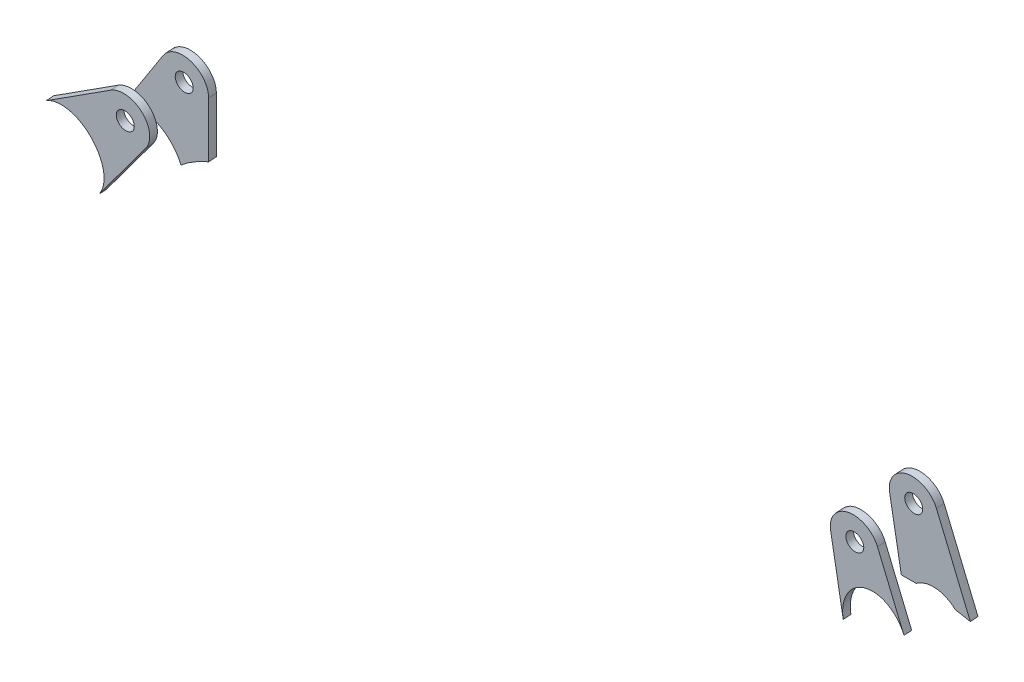
ISO-10303-21;
HEADER;
FILE_DESCRIPTION(('STEP AP214'),'2;1');
FILE_NAME('part.step','',(''),(''),'','','');
FILE_SCHEMA(('AUTOMOTIVE_DESIGN { 1 0 10303 214 1 1 1 1 }'));
ENDSEC;
DATA;
#1=APPLICATION_CONTEXT('core data for automotive mechanical design processes');
#2=APPLICATION_PROTOCOL_DEFINITION('international standard','automotive_design',2000,#1);
#3=PRODUCT_CONTEXT('',#1,'mechanical');
#4=PRODUCT('Part','Part','',(#3));
#5=PRODUCT_RELATED_PRODUCT_CATEGORY('part','',(#4));
#6=PRODUCT_DEFINITION_FORMATION('','',#4);
#7=PRODUCT_DEFINITION_CONTEXT('part definition',#1,'design');
#8=PRODUCT_DEFINITION('design','',#6,#7);
#9=PRODUCT_DEFINITION_SHAPE('','',#8);
#10=(LENGTH_UNIT() NAMED_UNIT(*) SI_UNIT(.MILLI.,.METRE.));
#11=(NAMED_UNIT(*) PLANE_ANGLE_UNIT() SI_UNIT($,.RADIAN.));
#12=(NAMED_UNIT(*) SI_UNIT($,.STERADIAN.) SOLID_ANGLE_UNIT());
#13=UNCERTAINTY_MEASURE_WITH_UNIT(LENGTH_MEASURE(1.E-05),#10,'distance_accuracy_value','');
#14=(GEOMETRIC_REPRESENTATION_CONTEXT(3) GLOBAL_UNCERTAINTY_ASSIGNED_CONTEXT((#13)) GLOBAL_UNIT_ASSIGNED_CONTEXT((#10,
#11,#12)) REPRESENTATION_CONTEXT('',''));
#15=CARTESIAN_POINT('',(0.,0.,0.));
#16=DIRECTION('',(0.,0.,1.));
#17=DIRECTION('',(1.,0.,0.));
#18=AXIS2_PLACEMENT_3D('',#15,#16,#17);
#19=CARTESIAN_POINT('',(1187.27362271244,209.902037191295,105.437735979484));
#20=CARTESIAN_POINT('',(1194.5083932304,186.019488933913,103.927112172512));
#21=CARTESIAN_POINT('',(1245.48987883513,201.401832465751,104.900079298838));
#22=CARTESIAN_POINT('',(1238.25510831716,225.284380723133,106.41070310581));
#23=CARTESIAN_POINT('',(1231.02033779919,249.166928980515,107.921326912782));
#24=CARTESIAN_POINT('',(1180.03885219447,233.784585448677,106.948359786456));
#25=CARTESIAN_POINT('',(1187.27362271244,209.902037191295,105.437735979484));
#26=(BOUNDED_CURVE() B_SPLINE_CURVE(3,(#19,#20,#21,#22,#23,#24,#25),.UNSPECIFIED.,.T.,
.F.) B_SPLINE_CURVE_WITH_KNOTS((4,3,4),(0.,0.5,1.),
.UNSPECIFIED.) CURVE() GEOMETRIC_REPRESENTATION_ITEM() RATIONAL_B_SPLINE_CURVE((1.,
0.333333333333333,0.333333333333333,1.,0.333333333333333,0.333333333333333,1.)) REPRESENTATION_ITEM(''));
#27=DIRECTION('',(-8.3575878583909E-13,-0.0631260510865013,0.998005561945536));
#28=VECTOR('',#27,1.);
#29=SURFACE_OF_LINEAR_EXTRUSION('',#26,#28);
#30=CARTESIAN_POINT('',(1187.27362271243,209.712659038036,108.431752665321));
#31=CARTESIAN_POINT('',(1194.5083932304,185.830110780654,106.921128858349));
#32=CARTESIAN_POINT('',(1245.48987883512,201.212454312491,107.894095984675));
#33=CARTESIAN_POINT('',(1238.25510831716,225.095002569873,109.404719791647));
#34=CARTESIAN_POINT('',(1231.02033779919,248.977550827255,110.915343598619));
#35=CARTESIAN_POINT('',(1180.03885219447,233.595207295418,109.942376472293));
#36=CARTESIAN_POINT('',(1187.27362271243,209.712659038036,108.431752665321));
#37=(BOUNDED_CURVE() B_SPLINE_CURVE(3,(#30,#31,#32,#33,#34,#35,#36),.UNSPECIFIED.,.T.,
.F.) B_SPLINE_CURVE_WITH_KNOTS((4,3,4),(0.,0.5,1.),
.UNSPECIFIED.) CURVE() GEOMETRIC_REPRESENTATION_ITEM() RATIONAL_B_SPLINE_CURVE((1.,
0.333333333333333,0.333333333333333,1.,0.333333333333333,0.333333333333333,1.)) REPRESENTATION_ITEM(''));
#38=CARTESIAN_POINT('',(1203.03694615696,227.107698866066,109.532027267707));
#39=VERTEX_POINT('',#38);
#40=CARTESIAN_POINT('',(1191.83086418841,220.088411076076,109.088041846657));
#41=VERTEX_POINT('',#40);
#42=EDGE_CURVE('E129',#39,#41,#37,.T.);
#43=ORIENTED_EDGE('',*,*,#42,.T.);
#44=DIRECTION('',(-8.3575878583909E-13,-0.0631260510865013,0.998005561945536));
#45=VECTOR('',#44,1.);
#46=CARTESIAN_POINT('',(1191.83086418841,220.277789229335,106.09402516082));
#47=LINE('',#46,#45);
#48=CARTESIAN_POINT('',(1191.83086418841,220.277789229335,106.09402516082));
#49=VERTEX_POINT('',#48);
#50=EDGE_CURVE('E12',#49,#41,#47,.T.);
#51=ORIENTED_EDGE('',*,*,#50,.F.);
#52=CARTESIAN_POINT('',(1203.03694615696,227.297077019326,106.538010581871));
#53=VERTEX_POINT('',#52);
#54=EDGE_CURVE('E117',#53,#49,#26,.T.);
#55=ORIENTED_EDGE('',*,*,#54,.F.);
#56=DIRECTION('',(-8.3575878583909E-13,-0.0631260510865013,0.998005561945536));
#57=VECTOR('',#56,1.);
#58=CARTESIAN_POINT('',(1203.03694615696,227.297077019326,106.538010581871));
#59=LINE('',#58,#57);
#60=EDGE_CURVE('E125',#53,#39,#59,.T.);
#61=ORIENTED_EDGE('',*,*,#60,.T.);
#62=EDGE_LOOP('',(#43,#51,#55,#61));
#63=FACE_BOUND('',#62,.T.);
#64=ADVANCED_FACE('F47',(#63),#29,.F.);
#65=CARTESIAN_POINT('',(1191.83086418841,220.277789229335,106.09402516082));
#66=CARTESIAN_POINT('',(1186.13050383243,238.157629322164,107.224964448286));
#67=CARTESIAN_POINT('',(1169.25353507531,239.801776105636,107.328960355514));
#68=CARTESIAN_POINT('',(1166.16568846541,222.77807922332,106.252174012779));
#69=CARTESIAN_POINT('',(1163.07784185551,205.754382341004,105.175387670043));
#70=CARTESIAN_POINT('',(1178.3469013087,195.245624045875,104.510685549859));
#71=CARTESIAN_POINT('',(1189.38568132259,206.797180511207,105.241346952333));
#72=(BOUNDED_CURVE() B_SPLINE_CURVE(3,(#65,#66,#67,#68,#69,#70,#71),.UNSPECIFIED.,.F.,
.F.) B_SPLINE_CURVE_WITH_KNOTS((4,3,4),(0.,0.5,1.),
.UNSPECIFIED.) CURVE() GEOMETRIC_REPRESENTATION_ITEM() RATIONAL_B_SPLINE_CURVE((1.,
0.506907294636358,0.506907294636358,1.,0.506907294636358,0.506907294636358,1.)) REPRESENTATION_ITEM(''));
#73=DIRECTION('',(-8.3575878583909E-13,-0.0631260510865013,0.998005561945536));
#74=VECTOR('',#73,1.);
#75=SURFACE_OF_LINEAR_EXTRUSION('',#72,#74);
#76=CARTESIAN_POINT('',(1191.83086418841,220.088411076076,109.088041846657));
#77=CARTESIAN_POINT('',(1186.13050383243,237.968251168904,110.218981134123));
#78=CARTESIAN_POINT('',(1169.25353507531,239.612397952377,110.322977041351));
#79=CARTESIAN_POINT('',(1166.16568846541,222.588701070061,109.246190698615));
#80=CARTESIAN_POINT('',(1163.07784185551,205.565004187745,108.16940435588));
#81=CARTESIAN_POINT('',(1178.3469013087,195.056245892616,107.504702235695));
#82=CARTESIAN_POINT('',(1189.38568132258,206.607802357947,108.23536363817));
#83=(BOUNDED_CURVE() B_SPLINE_CURVE(3,(#76,#77,#78,#79,#80,#81,#82),.UNSPECIFIED.,.F.,
.F.) B_SPLINE_CURVE_WITH_KNOTS((4,3,4),(0.,0.5,1.),
.UNSPECIFIED.) CURVE() GEOMETRIC_REPRESENTATION_ITEM() RATIONAL_B_SPLINE_CURVE((1.,
0.506907294636358,0.506907294636358,1.,0.506907294636358,0.506907294636358,1.)) REPRESENTATION_ITEM(''));
#84=CARTESIAN_POINT('',(1167.97984534794,227.173436112143,109.536185293357));
#85=VERTEX_POINT('',#84);
#86=EDGE_CURVE('E134',#41,#85,#83,.T.);
#87=ORIENTED_EDGE('',*,*,#86,.T.);
#88=DIRECTION('',(-8.3575878583909E-13,-0.0631260510865013,0.998005561945536));
#89=VECTOR('',#88,1.);
#90=CARTESIAN_POINT('',(1167.97984534795,227.362814265402,106.54216860752));
#91=LINE('',#90,#89);
#92=CARTESIAN_POINT('',(1167.97984534795,227.362814265402,106.54216860752));
#93=VERTEX_POINT('',#92);
#94=EDGE_CURVE('E56',#93,#85,#91,.T.);
#95=ORIENTED_EDGE('',*,*,#94,.F.);
#96=EDGE_CURVE('E97',#49,#93,#72,.T.);
#97=ORIENTED_EDGE('',*,*,#96,.F.);
#98=ORIENTED_EDGE('',*,*,#50,.T.);
#99=EDGE_LOOP('',(#87,#95,#97,#98));
#100=FACE_BOUND('',#99,.T.);
#101=ADVANCED_FACE('F150',(#100),#75,.F.);
#102=CARTESIAN_POINT('',(702.660949145776,-471.67377247901,62.3265640366125));
#103=DIRECTION('',(-0.83294757607652,0.552248283178659,0.0349309208935801));
#104=DIRECTION('',(-0.552585509997862,-0.833456210091689,0.));
#105=AXIS2_PLACEMENT_3D('',#102,#103,#104);
#106=PLANE('',#105);
#107=DIRECTION('',(-0.553351909284001,-0.83128631373339,-0.0525806912402454));
#108=VECTOR('',#107,1.);
#109=CARTESIAN_POINT('',(702.660949145773,-471.863150632269,65.3205807224491));
#110=LINE('',#109,#108);
#111=CARTESIAN_POINT('',(1187.08699802723,255.877619201086,111.351788128828));
#112=VERTEX_POINT('',#111);
#113=EDGE_CURVE('E109',#112,#85,#110,.T.);
#114=ORIENTED_EDGE('',*,*,#113,.F.);
#115=DIRECTION('',(-8.3575878583909E-13,-0.0631260510865013,0.998005561945536));
#116=VECTOR('',#115,1.);
#117=CARTESIAN_POINT('',(1187.08699802723,256.066997354345,108.357771442992));
#118=LINE('',#117,#116);
#119=CARTESIAN_POINT('',(1187.08699802723,256.066997354345,108.357771442992));
#120=VERTEX_POINT('',#119);
#121=EDGE_CURVE('E103',#120,#112,#118,.T.);
#122=ORIENTED_EDGE('',*,*,#121,.F.);
#123=DIRECTION('',(-0.553351909284001,-0.83128631373339,-0.0525806912402454));
#124=VECTOR('',#123,1.);
#125=CARTESIAN_POINT('',(702.660949145776,-471.67377247901,62.3265640366125));
#126=LINE('',#125,#124);
#127=EDGE_CURVE('E107',#120,#93,#126,.T.);
#128=ORIENTED_EDGE('',*,*,#127,.T.);
#129=ORIENTED_EDGE('',*,*,#94,.T.);
#130=EDGE_LOOP('',(#114,#122,#128,#129));
#131=FACE_BOUND('',#130,.T.);
#132=ADVANCED_FACE('F105',(#131),#106,.T.);
#133=CARTESIAN_POINT('',(1194.99999999992,250.820638664096,108.025927694499));
#134=DIRECTION('',(-8.3575878583909E-13,-0.0631260510865013,0.998005561945536));
#135=DIRECTION('',(0.,-0.998005561945536,-0.0631260510865013));
#136=AXIS2_PLACEMENT_3D('',#133,#134,#135);
#137=CYLINDRICAL_SURFACE('',#136,9.50000000000025);
#138=CARTESIAN_POINT('',(1194.99999999992,250.631260510836,111.019944380336));
#139=DIRECTION('',(8.35768954043914E-13,0.0631260510865013,-0.998005561945536));
#140=DIRECTION('',(0.,0.998005561945536,0.0631260510865013));
#141=AXIS2_PLACEMENT_3D('',#138,#139,#140);
#142=CIRCLE('',#141,9.50000000000025);
#143=CARTESIAN_POINT('',(1204.48128229763,250.03639059854,110.982317547483));
#144=VERTEX_POINT('',#143);
#145=EDGE_CURVE('E83',#112,#144,#142,.T.);
#146=ORIENTED_EDGE('',*,*,#145,.T.);
#147=DIRECTION('',(-8.3575878583909E-13,-0.0631260510865013,0.998005561945536));
#148=VECTOR('',#147,1.);
#149=CARTESIAN_POINT('',(1204.48128229764,250.2257687518,107.988300861647));
#150=LINE('',#149,#148);
#151=CARTESIAN_POINT('',(1204.48128229764,250.2257687518,107.988300861647));
#152=VERTEX_POINT('',#151);
#153=EDGE_CURVE('E110',#152,#144,#150,.T.);
#154=ORIENTED_EDGE('',*,*,#153,.F.);
#155=CARTESIAN_POINT('',(1194.99999999992,250.820638664096,108.025927694499));
#156=DIRECTION('',(8.35768954043914E-13,0.0631260510865013,-0.998005561945536));
#157=DIRECTION('',(0.,0.998005561945536,0.0631260510865013));
#158=AXIS2_PLACEMENT_3D('',#155,#156,#157);
#159=CIRCLE('',#158,9.50000000000025);
#160=EDGE_CURVE('E112',#120,#152,#159,.T.);
#161=ORIENTED_EDGE('',*,*,#160,.F.);
#162=ORIENTED_EDGE('',*,*,#121,.T.);
#163=EDGE_LOOP('',(#146,#154,#161,#162));
#164=FACE_BOUND('',#163,.T.);
#165=ADVANCED_FACE('F113',(#164),#137,.T.);
#166=CARTESIAN_POINT('',(1194.99999999992,250.820638664096,108.025927694499));
#167=DIRECTION('',(-8.3575878583909E-13,-0.0631260510865013,0.998005561945536));
#168=DIRECTION('',(0.,-0.998005561945536,-0.0631260510865013));
#169=AXIS2_PLACEMENT_3D('',#166,#167,#168);
#170=CYLINDRICAL_SURFACE('',#169,3.49999999999995);
#171=CARTESIAN_POINT('',(1194.99999999992,250.820638664096,108.025927694499));
#172=DIRECTION('',(8.35768954043914E-13,0.0631260510865013,-0.998005561945536));
#173=DIRECTION('',(0.,0.998005561945536,0.0631260510865013));
#174=AXIS2_PLACEMENT_3D('',#171,#172,#173);
#175=CIRCLE('',#174,3.49999999999995);
#176=CARTESIAN_POINT('',(1194.99999999992,254.313658130905,108.246868873302));
#177=VERTEX_POINT('',#176);
#178=EDGE_CURVE('E148',#177,#177,#175,.T.);
#179=ORIENTED_EDGE('',*,*,#178,.T.);
#180=EDGE_LOOP('',(#179));
#181=FACE_BOUND('',#180,.T.);
#182=CARTESIAN_POINT('',(1194.99999999992,250.631260510836,111.019944380336));
#183=DIRECTION('',(8.35768954043914E-13,0.0631260510865013,-0.998005561945536));
#184=DIRECTION('',(0.,0.998005561945536,0.0631260510865013));
#185=AXIS2_PLACEMENT_3D('',#182,#183,#184);
#186=CIRCLE('',#185,3.49999999999995);
#187=CARTESIAN_POINT('',(1194.99999999992,254.124279977646,111.240885559139));
#188=VERTEX_POINT('',#187);
#189=EDGE_CURVE('E126',#188,#188,#186,.T.);
#190=ORIENTED_EDGE('',*,*,#189,.F.);
#191=EDGE_LOOP('',(#190));
#192=FACE_BOUND('',#191,.T.);
#193=ADVANCED_FACE('F49',(#181,#192),#170,.F.);
#194=CARTESIAN_POINT('',(1183.67501105942,-80.0717055605428,87.0962577386059));
#195=DIRECTION('',(-0.998029715544938,0.0626178855623673,0.00396071925130242));
#196=DIRECTION('',(-0.0626183767208298,-0.998037543831317,0.));
#197=AXIS2_PLACEMENT_3D('',#194,#195,#196);
#198=PLANE('',#197);
#199=DIRECTION('',(-0.0627430226343086,-0.996039207100766,-0.0630016748093885));
#200=VECTOR('',#199,1.);
#201=CARTESIAN_POINT('',(1183.67501105942,-80.2610837138023,90.0902744244425));
#202=LINE('',#201,#200);
#203=EDGE_CURVE('E89',#144,#39,#202,.T.);
#204=ORIENTED_EDGE('',*,*,#203,.T.);
#205=ORIENTED_EDGE('',*,*,#60,.F.);
#206=DIRECTION('',(-0.0627430226343086,-0.996039207100766,-0.0630016748093885));
#207=VECTOR('',#206,1.);
#208=CARTESIAN_POINT('',(1183.67501105942,-80.0717055605428,87.0962577386059));
#209=LINE('',#208,#207);
#210=EDGE_CURVE('E64',#152,#53,#209,.T.);
#211=ORIENTED_EDGE('',*,*,#210,.F.);
#212=ORIENTED_EDGE('',*,*,#153,.T.);
#213=EDGE_LOOP('',(#204,#205,#211,#212));
#214=FACE_BOUND('',#213,.T.);
#215=ADVANCED_FACE('F157',(#214),#198,.F.);
#216=CARTESIAN_POINT('',(-7.68716854997691E-11,-5.80615491500186,91.7937174740899));
#217=DIRECTION('',(8.35768954043914E-13,0.0631260510865013,-0.998005561945536));
#218=DIRECTION('',(0.,0.998005561945536,0.0631260510865013));
#219=AXIS2_PLACEMENT_3D('',#216,#217,#218);
#220=PLANE('',#219);
#221=ORIENTED_EDGE('',*,*,#178,.F.);
#222=EDGE_LOOP('',(#221));
#223=FACE_BOUND('',#222,.T.);
#224=ORIENTED_EDGE('',*,*,#54,.T.);
#225=ORIENTED_EDGE('',*,*,#96,.T.);
#226=ORIENTED_EDGE('',*,*,#127,.F.);
#227=ORIENTED_EDGE('',*,*,#160,.T.);
#228=ORIENTED_EDGE('',*,*,#210,.T.);
#229=EDGE_LOOP('',(#224,#225,#226,#227,#228));
#230=FACE_BOUND('',#229,.T.);
#231=ADVANCED_FACE('F115',(#223,#230),#220,.T.);
#232=CARTESIAN_POINT('',(-7.93789618572864E-11,-5.99553306826137,94.7877341599265));
#233=DIRECTION('',(8.35768954043914E-13,0.0631260510865013,-0.998005561945536));
#234=DIRECTION('',(0.,0.998005561945536,0.0631260510865013));
#235=AXIS2_PLACEMENT_3D('',#232,#233,#234);
#236=PLANE('',#235);
#237=ORIENTED_EDGE('',*,*,#189,.T.);
#238=EDGE_LOOP('',(#237));
#239=FACE_BOUND('',#238,.T.);
#240=ORIENTED_EDGE('',*,*,#42,.F.);
#241=ORIENTED_EDGE('',*,*,#203,.F.);
#242=ORIENTED_EDGE('',*,*,#145,.F.);
#243=ORIENTED_EDGE('',*,*,#113,.T.);
#244=ORIENTED_EDGE('',*,*,#86,.F.);
#245=EDGE_LOOP('',(#240,#241,#242,#243,#244));
#246=FACE_BOUND('',#245,.T.);
#247=ADVANCED_FACE('F154',(#239,#246),#236,.F.);
#248=CLOSED_SHELL('',(#64,#101,#132,#165,#193,#215,#231,#247));
#249=MANIFOLD_SOLID_BREP('B2',#248);
#250=CARTESIAN_POINT('',(1499.08196942417,220.084161998798,106.081777812052));
#251=CARTESIAN_POINT('',(1496.21099658965,220.657520619572,106.118044008317));
#252=CARTESIAN_POINT('',(1493.33840835791,221.22603817707,106.154003996662));
#253=B_SPLINE_CURVE_WITH_KNOTS('',2,(#250,#251,#252),.UNSPECIFIED.,.F.,.F.,(3,3),(0.,1.),.UNSPECIFIED.);
#254=DIRECTION('',(-8.3575878583909E-13,-0.0631260510865013,0.998005561945536));
#255=VECTOR('',#254,1.);
#256=SURFACE_OF_LINEAR_EXTRUSION('',#253,#255);
#257=CARTESIAN_POINT('',(1499.08196942416,219.894783845539,109.075794497888));
#258=CARTESIAN_POINT('',(1496.21099658965,220.468142466313,109.112060694154));
#259=CARTESIAN_POINT('',(1493.33840835791,221.03666002381,109.148020682499));
#260=B_SPLINE_CURVE_WITH_KNOTS('',2,(#257,#258,#259),.UNSPECIFIED.,.F.,.F.,(3,3),(0.,1.),.UNSPECIFIED.);
#261=CARTESIAN_POINT('',(1499.0819694242,219.894783845435,109.075794497882));
#262=VERTEX_POINT('',#261);
#263=CARTESIAN_POINT('',(1493.33840835791,221.03666002381,109.148020682499));
#264=VERTEX_POINT('',#263);
#265=EDGE_CURVE('E348',#262,#264,#260,.T.);
#266=ORIENTED_EDGE('',*,*,#265,.T.);
#267=CARTESIAN_POINT('',(1493.33840835793,221.226038177067,106.154003996662));
#268=DIRECTION('',(-8.1416355139178E-13,-0.063126051086502,0.998005561945536));
#269=VECTOR('',#268,1.);
#270=LINE('',#267,#269);
#271=CARTESIAN_POINT('',(1493.33840835791,221.22603817707,106.154003996662));
#272=VERTEX_POINT('',#271);
#273=EDGE_CURVE('E45',#272,#264,#270,.T.);
#274=ORIENTED_EDGE('',*,*,#273,.F.);
#275=CARTESIAN_POINT('',(1493.33840835791,221.22603817707,106.154003996662));
#276=CARTESIAN_POINT('',(1496.21099658965,220.657520619572,106.118044008317));
#277=CARTESIAN_POINT('',(1499.08196942417,220.084161998798,106.081777812052));
#278=B_SPLINE_CURVE_WITH_KNOTS('',2,(#275,#276,#277),.UNSPECIFIED.,.F.,.F.,(3,3),(0.,1.),.UNSPECIFIED.);
#279=CARTESIAN_POINT('',(1499.0819694242,220.084161998694,106.081777812045));
#280=VERTEX_POINT('',#279);
#281=EDGE_CURVE('E501',#280,#272,#278,.F.);
#282=ORIENTED_EDGE('',*,*,#281,.F.);
#283=CARTESIAN_POINT('',(1499.08196942417,220.084161998798,106.081777812052));
#284=DIRECTION('',(-8.14163551391784E-13,-0.0631260510865023,0.998005561945536));
#285=VECTOR('',#284,1.);
#286=LINE('',#283,#285);
#287=EDGE_CURVE('E341',#280,#262,#286,.T.);
#288=ORIENTED_EDGE('',*,*,#287,.T.);
#289=EDGE_LOOP('',(#266,#274,#282,#288));
#290=FACE_BOUND('',#289,.T.);
#291=ADVANCED_FACE('F249',(#290),#256,.F.);
#292=CARTESIAN_POINT('',(1493.33840835793,221.226038177067,106.154003996662));
#293=CARTESIAN_POINT('',(1488.96893009491,225.763394960686,106.441001812144));
#294=CARTESIAN_POINT('',(1483.12142418807,226.290290564838,106.474329120215));
#295=CARTESIAN_POINT('',(1478.20006201535,222.590094625938,106.240283572996));
#296=(BOUNDED_CURVE() B_SPLINE_CURVE(3,(#292,#293,#294,#295),.UNSPECIFIED.,.F.,
.F.) B_SPLINE_CURVE_WITH_KNOTS((4,4),(0.,1.),
.UNSPECIFIED.) CURVE() GEOMETRIC_REPRESENTATION_ITEM() RATIONAL_B_SPLINE_CURVE((1.,
0.862951748646617,0.862951748646617,1.)) REPRESENTATION_ITEM(''));
#297=DIRECTION('',(-8.3575878583909E-13,-0.0631260510865013,0.998005561945536));
#298=VECTOR('',#297,1.);
#299=SURFACE_OF_LINEAR_EXTRUSION('',#296,#298);
#300=CARTESIAN_POINT('',(1493.33840835793,221.036660023808,109.148020682499));
#301=CARTESIAN_POINT('',(1488.96893009491,225.574016807427,109.43501849798));
#302=CARTESIAN_POINT('',(1483.12142418807,226.100912411578,109.468345806052));
#303=CARTESIAN_POINT('',(1478.20006201534,222.400716472678,109.234300258833));
#304=(BOUNDED_CURVE() B_SPLINE_CURVE(3,(#300,#301,#302,#303),.UNSPECIFIED.,.F.,
.F.) B_SPLINE_CURVE_WITH_KNOTS((4,4),(0.,1.),
.UNSPECIFIED.) CURVE() GEOMETRIC_REPRESENTATION_ITEM() RATIONAL_B_SPLINE_CURVE((1.,
0.862951748646617,0.862951748646617,1.)) REPRESENTATION_ITEM(''));
#305=CARTESIAN_POINT('',(1478.20006201541,222.40071647268,109.234300258833));
#306=VERTEX_POINT('',#305);
#307=EDGE_CURVE('E382',#264,#306,#304,.T.);
#308=ORIENTED_EDGE('',*,*,#307,.T.);
#309=CARTESIAN_POINT('',(1478.20006201541,222.590094625939,106.240283572996));
#310=DIRECTION('',(-8.1416355139178E-13,-0.063126051086502,0.998005561945536));
#311=VECTOR('',#310,1.);
#312=LINE('',#309,#311);
#313=CARTESIAN_POINT('',(1478.20006201541,222.590094625939,106.240283572996));
#314=VERTEX_POINT('',#313);
#315=EDGE_CURVE('E260',#314,#306,#312,.T.);
#316=ORIENTED_EDGE('',*,*,#315,.F.);
#317=EDGE_CURVE('E304',#272,#314,#296,.T.);
#318=ORIENTED_EDGE('',*,*,#317,.F.);
#319=ORIENTED_EDGE('',*,*,#273,.T.);
#320=EDGE_LOOP('',(#308,#316,#318,#319));
#321=FACE_BOUND('',#320,.T.);
#322=ADVANCED_FACE('F417',(#321),#299,.F.);
#323=CARTESIAN_POINT('',(1478.20006201541,222.590094625939,106.240283572996));
#324=CARTESIAN_POINT('',(1475.2865055703,222.571793232289,106.239125969515));
#325=CARTESIAN_POINT('',(1472.3780187023,222.55013712231,106.237756172833));
#326=B_SPLINE_CURVE_WITH_KNOTS('',2,(#323,#324,#325),.UNSPECIFIED.,.F.,.F.,(3,3),(0.,1.),.UNSPECIFIED.);
#327=DIRECTION('',(-8.3575878583909E-13,-0.0631260510865013,0.998005561945536));
#328=VECTOR('',#327,1.);
#329=SURFACE_OF_LINEAR_EXTRUSION('',#326,#328);
#330=CARTESIAN_POINT('',(1478.20006201541,222.40071647268,109.234300258833));
#331=CARTESIAN_POINT('',(1475.2865055703,222.382415079029,109.233142655351));
#332=CARTESIAN_POINT('',(1472.3780187023,222.36075896905,109.231772858669));
#333=B_SPLINE_CURVE_WITH_KNOTS('',2,(#330,#331,#332),.UNSPECIFIED.,.F.,.F.,(3,3),(0.,1.),.UNSPECIFIED.);
#334=CARTESIAN_POINT('',(1472.37801870234,222.360758968719,109.231772858648));
#335=VERTEX_POINT('',#334);
#336=EDGE_CURVE('E384',#306,#335,#333,.T.);
#337=ORIENTED_EDGE('',*,*,#336,.T.);
#338=CARTESIAN_POINT('',(1472.3780187023,222.36075896905,109.231772858669));
#339=DIRECTION('',(8.1416355139178E-13,0.063126051086502,-0.998005561945536));
#340=VECTOR('',#339,1.);
#341=LINE('',#338,#340);
#342=CARTESIAN_POINT('',(1472.37801870234,222.550137121978,106.237756172812));
#343=VERTEX_POINT('',#342);
#344=EDGE_CURVE('E320',#343,#335,#341,.F.);
#345=ORIENTED_EDGE('',*,*,#344,.F.);
#346=CARTESIAN_POINT('',(1472.3780187023,222.55013712231,106.237756172833));
#347=CARTESIAN_POINT('',(1475.2865055703,222.571793232289,106.239125969515));
#348=CARTESIAN_POINT('',(1478.20006201541,222.590094625939,106.240283572996));
#349=B_SPLINE_CURVE_WITH_KNOTS('',2,(#346,#347,#348),.UNSPECIFIED.,.F.,.F.,(3,3),(0.,1.),.UNSPECIFIED.);
#350=EDGE_CURVE('E328',#314,#343,#349,.F.);
#351=ORIENTED_EDGE('',*,*,#350,.F.);
#352=ORIENTED_EDGE('',*,*,#315,.T.);
#353=EDGE_LOOP('',(#337,#345,#351,#352));
#354=FACE_BOUND('',#353,.T.);
#355=ADVANCED_FACE('F412',(#354),#329,.F.);
#356=CARTESIAN_POINT('',(1480.21243523966,146.924027649801,101.45423809231));
#357=DIRECTION('',(-0.994697983824757,-0.102634190234857,-0.00649183870697924));
#358=DIRECTION('',(0.102636353009325,-0.994718944748186,0.));
#359=AXIS2_PLACEMENT_3D('',#356,#357,#358);
#360=PLANE('',#359);
#361=DIRECTION('',(0.102839296842025,-0.992714120313124,-0.0627913557424757));
#362=VECTOR('',#361,1.);
#363=CARTESIAN_POINT('',(1480.21243523966,146.734649496541,104.448254778147));
#364=LINE('',#363,#362);
#365=CARTESIAN_POINT('',(1469.55036915351,249.65623570392,110.958271912878));
#366=VERTEX_POINT('',#365);
#367=EDGE_CURVE('E319',#366,#335,#364,.T.);
#368=ORIENTED_EDGE('',*,*,#367,.F.);
#369=DIRECTION('',(-8.3575878583909E-13,-0.0631260510865013,0.998005561945536));
#370=VECTOR('',#369,1.);
#371=CARTESIAN_POINT('',(1469.55036915351,249.84561385718,107.964255227041));
#372=LINE('',#371,#370);
#373=CARTESIAN_POINT('',(1469.55036915351,249.84561385718,107.964255227041));
#374=VERTEX_POINT('',#373);
#375=EDGE_CURVE('E313',#374,#366,#372,.T.);
#376=ORIENTED_EDGE('',*,*,#375,.F.);
#377=DIRECTION('',(0.102839296842025,-0.992714120313124,-0.0627913557424757));
#378=VECTOR('',#377,1.);
#379=CARTESIAN_POINT('',(1480.21243523966,146.924027649801,101.45423809231));
#380=LINE('',#379,#378);
#381=EDGE_CURVE('E317',#374,#343,#380,.T.);
#382=ORIENTED_EDGE('',*,*,#381,.T.);
#383=ORIENTED_EDGE('',*,*,#344,.T.);
#384=EDGE_LOOP('',(#368,#376,#382,#383));
#385=FACE_BOUND('',#384,.T.);
#386=ADVANCED_FACE('F315',(#385),#360,.T.);
#387=CARTESIAN_POINT('',(1478.99999999992,250.820638664133,108.02592769474));
#388=DIRECTION('',(-8.3575878583909E-13,-0.0631260510865013,0.998005561945536));
#389=DIRECTION('',(0.,-0.998005561945536,-0.0631260510865013));
#390=AXIS2_PLACEMENT_3D('',#387,#388,#389);
#391=CYLINDRICAL_SURFACE('',#390,9.49999999996091);
#392=CARTESIAN_POINT('',(1478.99999999992,250.631260510873,111.019944380576));
#393=DIRECTION('',(8.35768954043914E-13,0.0631260510865013,-0.998005561945536));
#394=DIRECTION('',(0.,0.998005561945536,0.0631260510865013));
#395=AXIS2_PLACEMENT_3D('',#392,#393,#394);
#396=CIRCLE('',#395,9.49999999996091);
#397=CARTESIAN_POINT('',(1488.02823215257,253.581886224663,111.206577959241));
#398=VERTEX_POINT('',#397);
#399=EDGE_CURVE('E290',#366,#398,#396,.T.);
#400=ORIENTED_EDGE('',*,*,#399,.T.);
#401=DIRECTION('',(-8.3575878583909E-13,-0.0631260510865013,0.998005561945536));
#402=VECTOR('',#401,1.);
#403=CARTESIAN_POINT('',(1488.02823215257,253.771264377922,108.212561273405));
#404=LINE('',#403,#402);
#405=CARTESIAN_POINT('',(1488.02823215257,253.771264377922,108.212561273405));
#406=VERTEX_POINT('',#405);
#407=EDGE_CURVE('E321',#406,#398,#404,.T.);
#408=ORIENTED_EDGE('',*,*,#407,.F.);
#409=CARTESIAN_POINT('',(1478.99999999992,250.820638664133,108.02592769474));
#410=DIRECTION('',(8.35768954043914E-13,0.0631260510865013,-0.998005561945536));
#411=DIRECTION('',(0.,0.998005561945536,0.0631260510865013));
#412=AXIS2_PLACEMENT_3D('',#409,#410,#411);
#413=CIRCLE('',#412,9.49999999996091);
#414=EDGE_CURVE('E323',#374,#406,#413,.T.);
#415=ORIENTED_EDGE('',*,*,#414,.F.);
#416=ORIENTED_EDGE('',*,*,#375,.T.);
#417=EDGE_LOOP('',(#400,#408,#415,#416));
#418=FACE_BOUND('',#417,.T.);
#419=ADVANCED_FACE('F324',(#418),#391,.T.);
#420=CARTESIAN_POINT('',(1478.99999999992,250.820638664133,108.02592769474));
#421=DIRECTION('',(-8.3575878583909E-13,-0.0631260510865013,0.998005561945536));
#422=DIRECTION('',(0.,-0.998005561945536,-0.0631260510865013));
#423=AXIS2_PLACEMENT_3D('',#420,#421,#422);
#424=CYLINDRICAL_SURFACE('',#423,3.49999999999974);
#425=CARTESIAN_POINT('',(1478.99999999992,250.820638664133,108.02592769474));
#426=DIRECTION('',(8.35768954043914E-13,0.0631260510865013,-0.998005561945536));
#427=DIRECTION('',(0.,0.998005561945536,0.0631260510865013));
#428=AXIS2_PLACEMENT_3D('',#425,#426,#427);
#429=CIRCLE('',#428,3.49999999999974);
#430=CARTESIAN_POINT('',(1478.99999999992,254.313658130942,108.246868873542));
#431=VERTEX_POINT('',#430);
#432=EDGE_CURVE('E397',#431,#431,#429,.T.);
#433=ORIENTED_EDGE('',*,*,#432,.T.);
#434=EDGE_LOOP('',(#433));
#435=FACE_BOUND('',#434,.T.);
#436=CARTESIAN_POINT('',(1478.99999999992,250.631260510873,111.019944380576));
#437=DIRECTION('',(8.35768954043914E-13,0.0631260510865013,-0.998005561945536));
#438=DIRECTION('',(0.,0.998005561945536,0.0631260510865013));
#439=AXIS2_PLACEMENT_3D('',#436,#437,#438);
#440=CIRCLE('',#439,3.49999999999974);
#441=CARTESIAN_POINT('',(1478.99999999992,254.124279977682,111.240885559379));
#442=VERTEX_POINT('',#441);
#443=EDGE_CURVE('E374',#442,#442,#440,.T.);
#444=ORIENTED_EDGE('',*,*,#443,.F.);
#445=EDGE_LOOP('',(#444));
#446=FACE_BOUND('',#445,.T.);
#447=ADVANCED_FACE('F251',(#435,#446),#424,.F.);
#448=CARTESIAN_POINT('',(1420.83310998599,458.5534936082,121.165488548421));
#449=DIRECTION('',(-0.950340226609853,-0.310592180393613,-0.0196456398591287));
#450=DIRECTION('',(0.310652134455682,-0.950523672171361,0.));
#451=AXIS2_PLACEMENT_3D('',#448,#449,#450);
#452=PLANE('',#451);
#453=DIRECTION('',(0.311212875194992,-0.948444831897231,-0.0599912256942712));
#454=VECTOR('',#453,1.);
#455=CARTESIAN_POINT('',(1420.83310998599,458.364115454941,124.159505234257));
#456=LINE('',#455,#454);
#457=EDGE_CURVE('E296',#398,#262,#456,.T.);
#458=ORIENTED_EDGE('',*,*,#457,.T.);
#459=ORIENTED_EDGE('',*,*,#287,.F.);
#460=DIRECTION('',(0.311212875194992,-0.948444831897231,-0.0599912256942712));
#461=VECTOR('',#460,1.);
#462=CARTESIAN_POINT('',(1420.83310998599,458.5534936082,121.165488548421));
#463=LINE('',#462,#461);
#464=EDGE_CURVE('E268',#406,#280,#463,.T.);
#465=ORIENTED_EDGE('',*,*,#464,.F.);
#466=ORIENTED_EDGE('',*,*,#407,.T.);
#467=EDGE_LOOP('',(#458,#459,#465,#466));
#468=FACE_BOUND('',#467,.T.);
#469=ADVANCED_FACE('F367',(#468),#452,.F.);
#470=CARTESIAN_POINT('',(-7.68716854997691E-11,-5.80615491500186,91.7937174740899));
#471=DIRECTION('',(8.35768954043914E-13,0.0631260510865013,-0.998005561945536));
#472=DIRECTION('',(0.,0.998005561945536,0.0631260510865013));
#473=AXIS2_PLACEMENT_3D('',#470,#471,#472);
#474=PLANE('',#473);
#475=ORIENTED_EDGE('',*,*,#432,.F.);
#476=EDGE_LOOP('',(#475));
#477=FACE_BOUND('',#476,.T.);
#478=ORIENTED_EDGE('',*,*,#281,.T.);
#479=ORIENTED_EDGE('',*,*,#317,.T.);
#480=ORIENTED_EDGE('',*,*,#350,.T.);
#481=ORIENTED_EDGE('',*,*,#381,.F.);
#482=ORIENTED_EDGE('',*,*,#414,.T.);
#483=ORIENTED_EDGE('',*,*,#464,.T.);
#484=EDGE_LOOP('',(#478,#479,#480,#481,#482,#483));
#485=FACE_BOUND('',#484,.T.);
#486=ADVANCED_FACE('F326',(#477,#485),#474,.T.);
#487=CARTESIAN_POINT('',(-7.93789618572864E-11,-5.99553306826137,94.7877341599265));
#488=DIRECTION('',(8.35768954043914E-13,0.0631260510865013,-0.998005561945536));
#489=DIRECTION('',(0.,0.998005561945536,0.0631260510865013));
#490=AXIS2_PLACEMENT_3D('',#487,#488,#489);
#491=PLANE('',#490);
#492=ORIENTED_EDGE('',*,*,#443,.T.);
#493=EDGE_LOOP('',(#492));
#494=FACE_BOUND('',#493,.T.);
#495=ORIENTED_EDGE('',*,*,#265,.F.);
#496=ORIENTED_EDGE('',*,*,#457,.F.);
#497=ORIENTED_EDGE('',*,*,#399,.F.);
#498=ORIENTED_EDGE('',*,*,#367,.T.);
#499=ORIENTED_EDGE('',*,*,#336,.F.);
#500=ORIENTED_EDGE('',*,*,#307,.F.);
#501=EDGE_LOOP('',(#495,#496,#497,#498,#499,#500));
#502=FACE_BOUND('',#501,.T.);
#503=ADVANCED_FACE('F355',(#494,#502),#491,.F.);
#504=CLOSED_SHELL('',(#291,#322,#355,#386,#419,#447,#469,#486,#503));
#505=MANIFOLD_SOLID_BREP('B6',#504);
#506=CARTESIAN_POINT('',(645.224181576412,-493.486146821277,86.9988423101958));
#507=DIRECTION('',(0.798160373048524,-0.60124349461881,-0.0380299759873861));
#508=DIRECTION('',(0.60167874974324,0.798738181200455,0.));
#509=AXIS2_PLACEMENT_3D('',#506,#507,#508);
#510=PLANE('',#509);
#511=DIRECTION('',(-0.602445033920142,-0.796568491626919,-0.0503847124847846));
#512=VECTOR('',#511,1.);
#513=CARTESIAN_POINT('',(645.224181576414,-493.296768668018,84.0048256243592));
#514=LINE('',#513,#512);
#515=CARTESIAN_POINT('',(1202.5825235439,243.656926290272,130.618770847369));
#516=VERTEX_POINT('',#515);
#517=CARTESIAN_POINT('',(1182.76254687984,217.450437687256,128.961152692273));
#518=VERTEX_POINT('',#517);
#519=EDGE_CURVE('E724',#516,#518,#514,.T.);
#520=ORIENTED_EDGE('',*,*,#519,.F.);
#521=DIRECTION('',(8.3575878583909E-13,0.0631260510865013,-0.998005561945536));
#522=VECTOR('',#521,1.);
#523=CARTESIAN_POINT('',(1202.5825235439,243.467548137012,133.612787533206));
#524=LINE('',#523,#522);
#525=CARTESIAN_POINT('',(1202.5825235439,243.467548137012,133.612787533206));
#526=VERTEX_POINT('',#525);
#527=EDGE_CURVE('E247',#526,#516,#524,.T.);
#528=ORIENTED_EDGE('',*,*,#527,.F.);
#529=DIRECTION('',(-0.602445033920142,-0.796568491626919,-0.0503847124847846));
#530=VECTOR('',#529,1.);
#531=CARTESIAN_POINT('',(645.224181576412,-493.486146821277,86.9988423101958));
#532=LINE('',#531,#530);
#533=CARTESIAN_POINT('',(1182.76254687984,217.261059533997,131.955169378109));
#534=VERTEX_POINT('',#533);
#535=EDGE_CURVE('E702',#526,#534,#532,.T.);
#536=ORIENTED_EDGE('',*,*,#535,.T.);
#537=DIRECTION('',(8.3575878583909E-13,0.0631260510865013,-0.998005561945536));
#538=VECTOR('',#537,1.);
#539=CARTESIAN_POINT('',(1182.76254687984,217.261059533997,131.955169378109));
#540=LINE('',#539,#538);
#541=EDGE_CURVE('E647',#534,#518,#540,.T.);
#542=ORIENTED_EDGE('',*,*,#541,.T.);
#543=EDGE_LOOP('',(#520,#528,#536,#542));
#544=FACE_BOUND('',#543,.T.);
#545=ADVANCED_FACE('F643',(#544),#510,.T.);
#546=CARTESIAN_POINT('',(1194.9999999999,249.179361335847,133.974072305083));
#547=DIRECTION('',(8.3575878583909E-13,0.0631260510865013,-0.998005561945536));
#548=DIRECTION('',(0.,0.998005561945536,0.0631260510865013));
#549=AXIS2_PLACEMENT_3D('',#546,#547,#548);
#550=CYLINDRICAL_SURFACE('',#549,9.50000000000079);
#551=CARTESIAN_POINT('',(1194.9999999999,249.368739489106,130.980055619247));
#552=DIRECTION('',(8.35775892937818E-13,0.0631260510865013,-0.998005561945536));
#553=DIRECTION('',(0.,0.998005561945536,0.0631260510865013));
#554=AXIS2_PLACEMENT_3D('',#551,#552,#553);
#555=CIRCLE('',#554,9.50000000000079);
#556=CARTESIAN_POINT('',(1189.77845263364,257.289247838645,131.481045226684));
#557=VERTEX_POINT('',#556);
#558=EDGE_CURVE('E730',#557,#516,#555,.T.);
#559=ORIENTED_EDGE('',*,*,#558,.F.);
#560=DIRECTION('',(8.3575878583909E-13,0.0631260510865013,-0.998005561945536));
#561=VECTOR('',#560,1.);
#562=CARTESIAN_POINT('',(1189.77845263364,257.099869685385,134.475061912521));
#563=LINE('',#562,#561);
#564=CARTESIAN_POINT('',(1189.77845263364,257.099869685385,134.475061912521));
#565=VERTEX_POINT('',#564);
#566=EDGE_CURVE('E653',#565,#557,#563,.T.);
#567=ORIENTED_EDGE('',*,*,#566,.F.);
#568=CARTESIAN_POINT('',(1194.9999999999,249.179361335847,133.974072305083));
#569=DIRECTION('',(8.35775892937818E-13,0.0631260510865013,-0.998005561945536));
#570=DIRECTION('',(0.,0.998005561945536,0.0631260510865013));
#571=AXIS2_PLACEMENT_3D('',#568,#569,#570);
#572=CIRCLE('',#571,9.50000000000079);
#573=EDGE_CURVE('E695',#565,#526,#572,.T.);
#574=ORIENTED_EDGE('',*,*,#573,.T.);
#575=ORIENTED_EDGE('',*,*,#527,.T.);
#576=EDGE_LOOP('',(#559,#567,#574,#575));
#577=FACE_BOUND('',#576,.T.);
#578=ADVANCED_FACE('F719',(#577),#550,.T.);
#579=CARTESIAN_POINT('',(237.717945806563,-368.039196045738,94.9336383924185));
#580=DIRECTION('',(0.549636564873422,-0.833737721001683,-0.0527357481511794));
#581=DIRECTION('',(0.834899481709759,0.550402448614444,0.));
#582=AXIS2_PLACEMENT_3D('',#579,#580,#581);
#583=PLANE('',#582);
#584=DIRECTION('',(-0.835403882295351,-0.54854034879227,-0.0346963858739055));
#585=VECTOR('',#584,1.);
#586=CARTESIAN_POINT('',(237.717945806565,-367.849817892478,91.9396217065819));
#587=LINE('',#586,#585);
#588=CARTESIAN_POINT('',(1163.55988190586,240.073689907147,130.392123249767));
#589=VERTEX_POINT('',#588);
#590=EDGE_CURVE('E699',#557,#589,#587,.T.);
#591=ORIENTED_EDGE('',*,*,#590,.T.);
#592=DIRECTION('',(8.3575878583909E-13,0.0631260510865013,-0.998005561945536));
#593=VECTOR('',#592,1.);
#594=CARTESIAN_POINT('',(1163.55988190585,239.884311753887,133.386139935604));
#595=LINE('',#594,#593);
#596=CARTESIAN_POINT('',(1163.55988190585,239.884311753887,133.386139935604));
#597=VERTEX_POINT('',#596);
#598=EDGE_CURVE('E697',#597,#589,#595,.T.);
#599=ORIENTED_EDGE('',*,*,#598,.F.);
#600=DIRECTION('',(-0.835403882295351,-0.54854034879227,-0.0346963858739055));
#601=VECTOR('',#600,1.);
#602=CARTESIAN_POINT('',(237.717945806563,-368.039196045738,94.9336383924185));
#603=LINE('',#602,#601);
#604=EDGE_CURVE('E691',#565,#597,#603,.T.);
#605=ORIENTED_EDGE('',*,*,#604,.F.);
#606=ORIENTED_EDGE('',*,*,#566,.T.);
#607=EDGE_LOOP('',(#591,#599,#605,#606));
#608=FACE_BOUND('',#607,.T.);
#609=ADVANCED_FACE('F698',(#608),#583,.F.);
#610=CARTESIAN_POINT('',(1194.9999999999,249.179361335847,133.974072305083));
#611=DIRECTION('',(8.3575878583909E-13,0.0631260510865013,-0.998005561945536));
#612=DIRECTION('',(0.,0.998005561945536,0.0631260510865013));
#613=AXIS2_PLACEMENT_3D('',#610,#611,#612);
#614=CYLINDRICAL_SURFACE('',#613,3.49999999999994);
#615=CARTESIAN_POINT('',(1194.9999999999,249.179361335847,133.974072305083));
#616=DIRECTION('',(8.35775892937818E-13,0.0631260510865013,-0.998005561945536));
#617=DIRECTION('',(0.,0.998005561945536,0.0631260510865013));
#618=AXIS2_PLACEMENT_3D('',#615,#616,#617);
#619=CIRCLE('',#618,3.49999999999994);
#620=CARTESIAN_POINT('',(1194.9999999999,252.672380802656,134.195013483886));
#621=VERTEX_POINT('',#620);
#622=EDGE_CURVE('E704',#621,#621,#619,.T.);
#623=ORIENTED_EDGE('',*,*,#622,.F.);
#624=EDGE_LOOP('',(#623));
#625=FACE_BOUND('',#624,.T.);
#626=CARTESIAN_POINT('',(1194.9999999999,249.368739489106,130.980055619247));
#627=DIRECTION('',(8.35775892937818E-13,0.0631260510865013,-0.998005561945536));
#628=DIRECTION('',(0.,0.998005561945536,0.0631260510865013));
#629=AXIS2_PLACEMENT_3D('',#626,#627,#628);
#630=CIRCLE('',#629,3.49999999999994);
#631=CARTESIAN_POINT('',(1194.9999999999,252.861758955915,131.200996798049));
#632=VERTEX_POINT('',#631);
#633=EDGE_CURVE('E728',#632,#632,#630,.T.);
#634=ORIENTED_EDGE('',*,*,#633,.T.);
#635=EDGE_LOOP('',(#634));
#636=FACE_BOUND('',#635,.T.);
#637=ADVANCED_FACE('F645',(#625,#636),#614,.F.);
#638=CARTESIAN_POINT('',(1163.52422828673,239.860795869838,133.384652504116));
#639=CARTESIAN_POINT('',(1142.69588923807,226.06157638298,132.511821462372));
#640=CARTESIAN_POINT('',(1159.34885191171,201.026002673985,130.928266254685));
#641=CARTESIAN_POINT('',(1180.17719096037,214.825222160843,131.801097296428));
#642=CARTESIAN_POINT('',(1201.00553000904,228.624441647701,132.673928338172));
#643=CARTESIAN_POINT('',(1184.35256733539,253.660015356696,134.257483545859));
#644=CARTESIAN_POINT('',(1163.52422828673,239.860795869838,133.384652504116));
#645=(BOUNDED_CURVE() B_SPLINE_CURVE(3,(#638,#639,#640,#641,#642,#643,#644),.UNSPECIFIED.,.T.,
.F.) B_SPLINE_CURVE_WITH_KNOTS((4,3,4),(0.,0.5,1.),
.UNSPECIFIED.) CURVE() GEOMETRIC_REPRESENTATION_ITEM() RATIONAL_B_SPLINE_CURVE((1.,
0.333333333333333,0.333333333333333,1.,0.333333333333333,0.333333333333333,1.)) REPRESENTATION_ITEM(''));
#646=DIRECTION('',(8.3575878583909E-13,0.0631260510865013,-0.998005561945536));
#647=VECTOR('',#646,1.);
#648=SURFACE_OF_LINEAR_EXTRUSION('',#645,#647);
#649=CARTESIAN_POINT('',(1163.52422828673,240.050174023097,130.390635818279));
#650=CARTESIAN_POINT('',(1142.69588923807,226.250954536239,129.517804776536));
#651=CARTESIAN_POINT('',(1159.34885191171,201.215380827244,127.934249568848));
#652=CARTESIAN_POINT('',(1180.17719096038,215.014600314103,128.807080610592));
#653=CARTESIAN_POINT('',(1201.00553000904,228.813819800961,129.679911652335));
#654=CARTESIAN_POINT('',(1184.35256733539,253.849393509956,131.263466860023));
#655=CARTESIAN_POINT('',(1163.52422828673,240.050174023097,130.390635818279));
#656=(BOUNDED_CURVE() B_SPLINE_CURVE(3,(#649,#650,#651,#652,#653,#654,#655),.UNSPECIFIED.,.T.,
.F.) B_SPLINE_CURVE_WITH_KNOTS((4,3,4),(0.,0.5,1.),
.UNSPECIFIED.) CURVE() GEOMETRIC_REPRESENTATION_ITEM() RATIONAL_B_SPLINE_CURVE((1.,
0.333333333333333,0.333333333333333,1.,0.333333333333333,0.333333333333333,1.)) REPRESENTATION_ITEM(''));
#657=EDGE_CURVE('E727',#518,#589,#656,.T.);
#658=ORIENTED_EDGE('',*,*,#657,.F.);
#659=ORIENTED_EDGE('',*,*,#541,.F.);
#660=EDGE_CURVE('E694',#534,#597,#645,.T.);
#661=ORIENTED_EDGE('',*,*,#660,.T.);
#662=ORIENTED_EDGE('',*,*,#598,.T.);
#663=EDGE_LOOP('',(#658,#659,#661,#662));
#664=FACE_BOUND('',#663,.T.);
#665=ADVANCED_FACE('F701',(#664),#648,.T.);
#666=CARTESIAN_POINT('',(-9.86024151099981E-11,-7.44743224325089,117.741862084674));
#667=DIRECTION('',(8.35775892937818E-13,0.0631260510865013,-0.998005561945536));
#668=DIRECTION('',(0.,0.998005561945536,0.0631260510865013));
#669=AXIS2_PLACEMENT_3D('',#666,#667,#668);
#670=PLANE('',#669);
#671=ORIENTED_EDGE('',*,*,#622,.T.);
#672=EDGE_LOOP('',(#671));
#673=FACE_BOUND('',#672,.T.);
#674=ORIENTED_EDGE('',*,*,#535,.F.);
#675=ORIENTED_EDGE('',*,*,#573,.F.);
#676=ORIENTED_EDGE('',*,*,#604,.T.);
#677=ORIENTED_EDGE('',*,*,#660,.F.);
#678=EDGE_LOOP('',(#674,#675,#676,#677));
#679=FACE_BOUND('',#678,.T.);
#680=ADVANCED_FACE('F693',(#673,#679),#670,.F.);
#681=CARTESIAN_POINT('',(-9.60951387524808E-11,-7.25805408999139,114.747845398837));
#682=DIRECTION('',(8.35775892937818E-13,0.0631260510865013,-0.998005561945536));
#683=DIRECTION('',(0.,0.998005561945536,0.0631260510865013));
#684=AXIS2_PLACEMENT_3D('',#681,#682,#683);
#685=PLANE('',#684);
#686=ORIENTED_EDGE('',*,*,#633,.F.);
#687=EDGE_LOOP('',(#686));
#688=FACE_BOUND('',#687,.T.);
#689=ORIENTED_EDGE('',*,*,#519,.T.);
#690=ORIENTED_EDGE('',*,*,#657,.T.);
#691=ORIENTED_EDGE('',*,*,#590,.F.);
#692=ORIENTED_EDGE('',*,*,#558,.T.);
#693=EDGE_LOOP('',(#689,#690,#691,#692));
#694=FACE_BOUND('',#693,.T.);
#695=ADVANCED_FACE('F731',(#688,#694),#685,.T.);
#696=CLOSED_SHELL('',(#545,#578,#609,#637,#665,#680,#695));
#697=MANIFOLD_SOLID_BREP('B39',#696);
#698=CARTESIAN_POINT('',(1420.83310998608,456.912216279991,147.113633159007));
#699=DIRECTION('',(0.950340226609852,0.310592180393615,0.0196456398591288));
#700=DIRECTION('',(-0.310652134455683,0.950523672171361,0.));
#701=AXIS2_PLACEMENT_3D('',#698,#699,#700);
#702=PLANE('',#701);
#703=DIRECTION('',(0.311212875194993,-0.94844483189723,-0.0599912256942711));
#704=VECTOR('',#703,1.);
#705=CARTESIAN_POINT('',(1420.83310998609,457.10159443325,144.11961647317));
#706=LINE('',#705,#704);
#707=CARTESIAN_POINT('',(1488.02823215267,252.319365202968,131.166689198154));
#708=VERTEX_POINT('',#707);
#709=CARTESIAN_POINT('',(1496.68270764579,225.944194994826,129.498401559835));
#710=VERTEX_POINT('',#709);
#711=EDGE_CURVE('E879',#708,#710,#706,.T.);
#712=ORIENTED_EDGE('',*,*,#711,.F.);
#713=DIRECTION('',(8.3575878583909E-13,0.0631260510865013,-0.998005561945536));
#714=VECTOR('',#713,1.);
#715=CARTESIAN_POINT('',(1488.02823215266,252.129987049709,134.160705883991));
#716=LINE('',#715,#714);
#717=CARTESIAN_POINT('',(1488.02823215266,252.129987049709,134.160705883991));
#718=VERTEX_POINT('',#717);
#719=EDGE_CURVE('E641',#718,#708,#716,.T.);
#720=ORIENTED_EDGE('',*,*,#719,.F.);
#721=DIRECTION('',(0.311212875194993,-0.94844483189723,-0.0599912256942711));
#722=VECTOR('',#721,1.);
#723=CARTESIAN_POINT('',(1420.83310998608,456.912216279991,147.113633159007));
#724=LINE('',#723,#722);
#725=CARTESIAN_POINT('',(1496.68270764579,225.754816841566,132.492418245672));
#726=VERTEX_POINT('',#725);
#727=EDGE_CURVE('E857',#718,#726,#724,.T.);
#728=ORIENTED_EDGE('',*,*,#727,.T.);
#729=DIRECTION('',(8.3575878583909E-13,0.0631260510865013,-0.998005561945536));
#730=VECTOR('',#729,1.);
#731=CARTESIAN_POINT('',(1496.68270764579,225.754816841566,132.492418245672));
#732=LINE('',#731,#730);
#733=EDGE_CURVE('E802',#726,#710,#732,.T.);
#734=ORIENTED_EDGE('',*,*,#733,.T.);
#735=EDGE_LOOP('',(#712,#720,#728,#734));
#736=FACE_BOUND('',#735,.T.);
#737=ADVANCED_FACE('F798',(#736),#702,.T.);
#738=CARTESIAN_POINT('',(1478.9999999999,249.179361335884,133.974072305323));
#739=DIRECTION('',(8.3575878583909E-13,0.0631260510865013,-0.998005561945536));
#740=DIRECTION('',(0.,0.998005561945536,0.0631260510865013));
#741=AXIS2_PLACEMENT_3D('',#738,#739,#740);
#742=CYLINDRICAL_SURFACE('',#741,9.49999999999913);
#743=CARTESIAN_POINT('',(1478.9999999999,249.368739489143,130.980055619487));
#744=DIRECTION('',(8.35775892937818E-13,0.0631260510865013,-0.998005561945536));
#745=DIRECTION('',(0.,0.998005561945536,0.0631260510865013));
#746=AXIS2_PLACEMENT_3D('',#743,#744,#745);
#747=CIRCLE('',#746,9.49999999999913);
#748=CARTESIAN_POINT('',(1469.55036915354,248.393714682184,130.918383151788));
#749=VERTEX_POINT('',#748);
#750=EDGE_CURVE('E885',#749,#708,#747,.T.);
#751=ORIENTED_EDGE('',*,*,#750,.F.);
#752=DIRECTION('',(8.3575878583909E-13,0.0631260510865013,-0.998005561945536));
#753=VECTOR('',#752,1.);
#754=CARTESIAN_POINT('',(1469.55036915354,248.204336528924,133.912399837624));
#755=LINE('',#754,#753);
#756=CARTESIAN_POINT('',(1469.55036915354,248.204336528924,133.912399837624));
#757=VERTEX_POINT('',#756);
#758=EDGE_CURVE('E808',#757,#749,#755,.T.);
#759=ORIENTED_EDGE('',*,*,#758,.F.);
#760=CARTESIAN_POINT('',(1478.9999999999,249.179361335884,133.974072305323));
#761=DIRECTION('',(8.35775892937818E-13,0.0631260510865013,-0.998005561945536));
#762=DIRECTION('',(0.,0.998005561945536,0.0631260510865013));
#763=AXIS2_PLACEMENT_3D('',#760,#761,#762);
#764=CIRCLE('',#763,9.49999999999913);
#765=EDGE_CURVE('E850',#757,#718,#764,.T.);
#766=ORIENTED_EDGE('',*,*,#765,.T.);
#767=ORIENTED_EDGE('',*,*,#719,.T.);
#768=EDGE_LOOP('',(#751,#759,#766,#767));
#769=FACE_BOUND('',#768,.T.);
#770=ADVANCED_FACE('F874',(#769),#742,.T.);
#771=CARTESIAN_POINT('',(1480.21243523969,145.282750321549,127.402382702894));
#772=DIRECTION('',(0.994697983824758,0.102634190234852,0.00649183870697895));
#773=DIRECTION('',(-0.10263635300932,0.994718944748187,0.));
#774=AXIS2_PLACEMENT_3D('',#771,#772,#773);
#775=PLANE('',#774);
#776=DIRECTION('',(0.102839296842021,-0.992714120313125,-0.0627913557424757));
#777=VECTOR('',#776,1.);
#778=CARTESIAN_POINT('',(1480.21243523969,145.472128474809,124.408366017057));
#779=LINE('',#778,#777);
#780=CARTESIAN_POINT('',(1472.58924495933,219.059257768099,129.062914107967));
#781=VERTEX_POINT('',#780);
#782=EDGE_CURVE('E854',#749,#781,#779,.T.);
#783=ORIENTED_EDGE('',*,*,#782,.T.);
#784=DIRECTION('',(8.3575878583909E-13,0.0631260510865013,-0.998005561945536));
#785=VECTOR('',#784,1.);
#786=CARTESIAN_POINT('',(1472.58924495933,218.86987961484,132.056930793804));
#787=LINE('',#786,#785);
#788=CARTESIAN_POINT('',(1472.58924495933,218.86987961484,132.056930793804));
#789=VERTEX_POINT('',#788);
#790=EDGE_CURVE('E852',#789,#781,#787,.T.);
#791=ORIENTED_EDGE('',*,*,#790,.F.);
#792=DIRECTION('',(0.102839296842021,-0.992714120313125,-0.0627913557424757));
#793=VECTOR('',#792,1.);
#794=CARTESIAN_POINT('',(1480.21243523969,145.282750321549,127.402382702894));
#795=LINE('',#794,#793);
#796=EDGE_CURVE('E846',#757,#789,#795,.T.);
#797=ORIENTED_EDGE('',*,*,#796,.F.);
#798=ORIENTED_EDGE('',*,*,#758,.T.);
#799=EDGE_LOOP('',(#783,#791,#797,#798));
#800=FACE_BOUND('',#799,.T.);
#801=ADVANCED_FACE('F853',(#800),#775,.F.);
#802=CARTESIAN_POINT('',(1478.9999999999,249.179361335884,133.974072305323));
#803=DIRECTION('',(8.3575878583909E-13,0.0631260510865013,-0.998005561945536));
#804=DIRECTION('',(0.,0.998005561945536,0.0631260510865013));
#805=AXIS2_PLACEMENT_3D('',#802,#803,#804);
#806=CYLINDRICAL_SURFACE('',#805,3.49999999999996);
#807=CARTESIAN_POINT('',(1478.9999999999,249.179361335884,133.974072305323));
#808=DIRECTION('',(8.35775892937818E-13,0.0631260510865013,-0.998005561945536));
#809=DIRECTION('',(0.,0.998005561945536,0.0631260510865013));
#810=AXIS2_PLACEMENT_3D('',#807,#808,#809);
#811=CIRCLE('',#810,3.49999999999996);
#812=CARTESIAN_POINT('',(1478.9999999999,252.672380802693,134.195013484126));
#813=VERTEX_POINT('',#812);
#814=EDGE_CURVE('E859',#813,#813,#811,.T.);
#815=ORIENTED_EDGE('',*,*,#814,.F.);
#816=EDGE_LOOP('',(#815));
#817=FACE_BOUND('',#816,.T.);
#818=CARTESIAN_POINT('',(1478.9999999999,249.368739489143,130.980055619487));
#819=DIRECTION('',(8.35775892937818E-13,0.0631260510865013,-0.998005561945536));
#820=DIRECTION('',(0.,0.998005561945536,0.0631260510865013));
#821=AXIS2_PLACEMENT_3D('',#818,#819,#820);
#822=CIRCLE('',#821,3.49999999999996);
#823=CARTESIAN_POINT('',(1478.9999999999,252.861758955952,131.20099679829));
#824=VERTEX_POINT('',#823);
#825=EDGE_CURVE('E883',#824,#824,#822,.T.);
#826=ORIENTED_EDGE('',*,*,#825,.T.);
#827=EDGE_LOOP('',(#826));
#828=FACE_BOUND('',#827,.T.);
#829=ADVANCED_FACE('F800',(#817,#828),#806,.F.);
#830=CARTESIAN_POINT('',(1484.99999999998,206.102580708729,131.249371002852));
#831=CARTESIAN_POINT('',(1509.99999999998,206.102580708693,131.249371002871));
#832=CARTESIAN_POINT('',(1510.00000000002,235.095516863578,133.083238106069));
#833=CARTESIAN_POINT('',(1485.00000000002,235.095516863614,133.08323810605));
#834=CARTESIAN_POINT('',(1460.00000000002,235.095516863651,133.083238106032));
#835=CARTESIAN_POINT('',(1459.99999999998,206.102580708765,131.249371002833));
#836=CARTESIAN_POINT('',(1484.99999999998,206.102580708729,131.249371002852));
#837=(BOUNDED_CURVE() B_SPLINE_CURVE(3,(#830,#831,#832,#833,#834,#835,#836),.UNSPECIFIED.,.T.,
.F.) B_SPLINE_CURVE_WITH_KNOTS((4,3,4),(0.,0.5,1.),
.UNSPECIFIED.) CURVE() GEOMETRIC_REPRESENTATION_ITEM() RATIONAL_B_SPLINE_CURVE((1.,
0.333333333333333,0.333333333333333,1.,0.333333333333333,0.333333333333333,1.)) REPRESENTATION_ITEM(''));
#838=DIRECTION('',(8.3575878583909E-13,0.0631260510865013,-0.998005561945536));
#839=VECTOR('',#838,1.);
#840=SURFACE_OF_LINEAR_EXTRUSION('',#837,#839);
#841=CARTESIAN_POINT('',(1484.99999999998,206.291958861988,128.255354317015));
#842=CARTESIAN_POINT('',(1509.99999999998,206.291958861952,128.255354317034));
#843=CARTESIAN_POINT('',(1510.00000000002,235.284895016837,130.089221420232));
#844=CARTESIAN_POINT('',(1485.00000000002,235.284895016874,130.089221420214));
#845=CARTESIAN_POINT('',(1460.00000000002,235.28489501691,130.089221420195));
#846=CARTESIAN_POINT('',(1459.99999999998,206.291958862025,128.255354316997));
#847=CARTESIAN_POINT('',(1484.99999999998,206.291958861988,128.255354317015));
#848=(BOUNDED_CURVE() B_SPLINE_CURVE(3,(#841,#842,#843,#844,#845,#846,#847),.UNSPECIFIED.,.T.,
.F.) B_SPLINE_CURVE_WITH_KNOTS((4,3,4),(0.,0.5,1.),
.UNSPECIFIED.) CURVE() GEOMETRIC_REPRESENTATION_ITEM() RATIONAL_B_SPLINE_CURVE((1.,
0.333333333333333,0.333333333333333,1.,0.333333333333333,0.333333333333333,1.)) REPRESENTATION_ITEM(''));
#849=EDGE_CURVE('E882',#710,#781,#848,.T.);
#850=ORIENTED_EDGE('',*,*,#849,.F.);
#851=ORIENTED_EDGE('',*,*,#733,.F.);
#852=EDGE_CURVE('E849',#726,#789,#837,.T.);
#853=ORIENTED_EDGE('',*,*,#852,.T.);
#854=ORIENTED_EDGE('',*,*,#790,.T.);
#855=EDGE_LOOP('',(#850,#851,#853,#854));
#856=FACE_BOUND('',#855,.T.);
#857=ADVANCED_FACE('F856',(#856),#840,.T.);
#858=CARTESIAN_POINT('',(-9.86024151099981E-11,-7.44743224325089,117.741862084674));
#859=DIRECTION('',(8.35775892937818E-13,0.0631260510865013,-0.998005561945536));
#860=DIRECTION('',(0.,0.998005561945536,0.0631260510865013));
#861=AXIS2_PLACEMENT_3D('',#858,#859,#860);
#862=PLANE('',#861);
#863=ORIENTED_EDGE('',*,*,#814,.T.);
#864=EDGE_LOOP('',(#863));
#865=FACE_BOUND('',#864,.T.);
#866=ORIENTED_EDGE('',*,*,#727,.F.);
#867=ORIENTED_EDGE('',*,*,#765,.F.);
#868=ORIENTED_EDGE('',*,*,#796,.T.);
#869=ORIENTED_EDGE('',*,*,#852,.F.);
#870=EDGE_LOOP('',(#866,#867,#868,#869));
#871=FACE_BOUND('',#870,.T.);
#872=ADVANCED_FACE('F848',(#865,#871),#862,.F.);
#873=CARTESIAN_POINT('',(-9.60951387524808E-11,-7.25805408999139,114.747845398837));
#874=DIRECTION('',(8.35775892937818E-13,0.0631260510865013,-0.998005561945536));
#875=DIRECTION('',(0.,0.998005561945536,0.0631260510865013));
#876=AXIS2_PLACEMENT_3D('',#873,#874,#875);
#877=PLANE('',#876);
#878=ORIENTED_EDGE('',*,*,#825,.F.);
#879=EDGE_LOOP('',(#878));
#880=FACE_BOUND('',#879,.T.);
#881=ORIENTED_EDGE('',*,*,#711,.T.);
#882=ORIENTED_EDGE('',*,*,#849,.T.);
#883=ORIENTED_EDGE('',*,*,#782,.F.);
#884=ORIENTED_EDGE('',*,*,#750,.T.);
#885=EDGE_LOOP('',(#881,#882,#883,#884));
#886=FACE_BOUND('',#885,.T.);
#887=ADVANCED_FACE('F886',(#880,#886),#877,.T.);
#888=CLOSED_SHELL('',(#737,#770,#801,#829,#857,#872,#887));
#889=MANIFOLD_SOLID_BREP('B241',#888);
#890=ADVANCED_BREP_SHAPE_REPRESENTATION('',(#18,#249,#505,#697,#889),#14);
#891=SHAPE_DEFINITION_REPRESENTATION(#9,#890);
ENDSEC;
END-ISO-10303-21;
